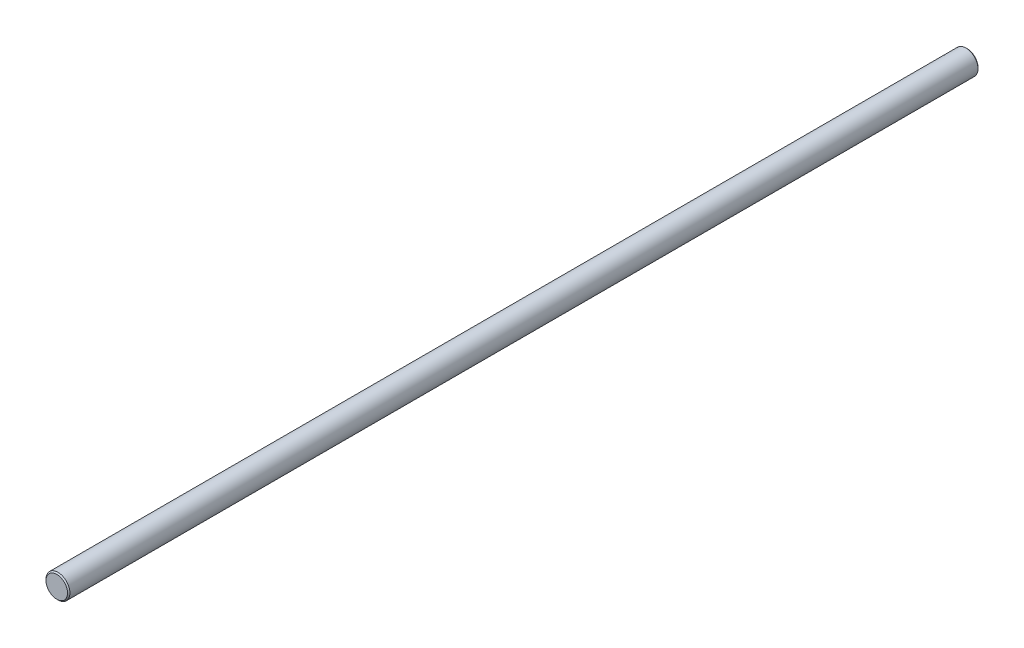
ISO-10303-21;
HEADER;
FILE_DESCRIPTION(('STEP AP214'),'2;1');
FILE_NAME('part.step','',(''),(''),'','','');
FILE_SCHEMA(('AUTOMOTIVE_DESIGN { 1 0 10303 214 1 1 1 1 }'));
ENDSEC;
DATA;
#1=APPLICATION_CONTEXT('core data for automotive mechanical design processes');
#2=APPLICATION_PROTOCOL_DEFINITION('international standard','automotive_design',2000,#1);
#3=PRODUCT_CONTEXT('',#1,'mechanical');
#4=PRODUCT('Part','Part','',(#3));
#5=PRODUCT_RELATED_PRODUCT_CATEGORY('part','',(#4));
#6=PRODUCT_DEFINITION_FORMATION('','',#4);
#7=PRODUCT_DEFINITION_CONTEXT('part definition',#1,'design');
#8=PRODUCT_DEFINITION('design','',#6,#7);
#9=PRODUCT_DEFINITION_SHAPE('','',#8);
#10=(LENGTH_UNIT() NAMED_UNIT(*) SI_UNIT(.MILLI.,.METRE.));
#11=(NAMED_UNIT(*) PLANE_ANGLE_UNIT() SI_UNIT($,.RADIAN.));
#12=(NAMED_UNIT(*) SI_UNIT($,.STERADIAN.) SOLID_ANGLE_UNIT());
#13=UNCERTAINTY_MEASURE_WITH_UNIT(LENGTH_MEASURE(1.E-05),#10,'distance_accuracy_value','');
#14=(GEOMETRIC_REPRESENTATION_CONTEXT(3) GLOBAL_UNCERTAINTY_ASSIGNED_CONTEXT((#13)) GLOBAL_UNIT_ASSIGNED_CONTEXT((#10,
#11,#12)) REPRESENTATION_CONTEXT('',''));
#15=CARTESIAN_POINT('',(0.,0.,0.));
#16=DIRECTION('',(0.,0.,1.));
#17=DIRECTION('',(1.,0.,0.));
#18=AXIS2_PLACEMENT_3D('',#15,#16,#17);
#19=CARTESIAN_POINT('',(0.,0.,-380.));
#20=DIRECTION('',(0.,0.,1.));
#21=DIRECTION('',(1.,0.,0.));
#22=AXIS2_PLACEMENT_3D('',#19,#20,#21);
#23=CYLINDRICAL_SURFACE('',#22,5.);
#24=CARTESIAN_POINT('',(0.,0.,-379.5));
#25=DIRECTION('',(0.,0.,1.));
#26=DIRECTION('',(1.,0.,0.));
#27=AXIS2_PLACEMENT_3D('',#24,#25,#26);
#28=CIRCLE('',#27,5.);
#29=CARTESIAN_POINT('',(5.,0.,-379.5));
#30=VERTEX_POINT('',#29);
#31=EDGE_CURVE('E45',#30,#30,#28,.T.);
#32=ORIENTED_EDGE('',*,*,#31,.T.);
#33=EDGE_LOOP('',(#32));
#34=FACE_BOUND('',#33,.T.);
#35=CARTESIAN_POINT('',(0.,0.,-0.5));
#36=DIRECTION('',(0.,0.,1.));
#37=DIRECTION('',(1.,0.,0.));
#38=AXIS2_PLACEMENT_3D('',#35,#36,#37);
#39=CIRCLE('',#38,5.);
#40=CARTESIAN_POINT('',(5.,0.,-0.5));
#41=VERTEX_POINT('',#40);
#42=EDGE_CURVE('E49',#41,#41,#39,.F.);
#43=ORIENTED_EDGE('',*,*,#42,.T.);
#44=EDGE_LOOP('',(#43));
#45=FACE_BOUND('',#44,.T.);
#46=ADVANCED_FACE('F34',(#34,#45),#23,.T.);
#47=CARTESIAN_POINT('',(0.,0.,-380.));
#48=DIRECTION('',(0.,0.,1.));
#49=DIRECTION('',(1.,0.,0.));
#50=AXIS2_PLACEMENT_3D('',#47,#48,#49);
#51=PLANE('',#50);
#52=CARTESIAN_POINT('',(0.,0.,-380.));
#53=DIRECTION('',(0.,0.,1.));
#54=DIRECTION('',(1.,0.,0.));
#55=AXIS2_PLACEMENT_3D('',#52,#53,#54);
#56=CIRCLE('',#55,4.50000000000006);
#57=CARTESIAN_POINT('',(4.50000000000006,0.,-380.));
#58=VERTEX_POINT('',#57);
#59=EDGE_CURVE('E41',#58,#58,#56,.F.);
#60=ORIENTED_EDGE('',*,*,#59,.T.);
#61=EDGE_LOOP('',(#60));
#62=FACE_BOUND('',#61,.T.);
#63=ADVANCED_FACE('F65',(#62),#51,.F.);
#64=CARTESIAN_POINT('',(0.,0.,0.));
#65=DIRECTION('',(0.,0.,1.));
#66=DIRECTION('',(1.,0.,0.));
#67=AXIS2_PLACEMENT_3D('',#64,#65,#66);
#68=PLANE('',#67);
#69=CARTESIAN_POINT('',(0.,0.,0.));
#70=DIRECTION('',(0.,0.,1.));
#71=DIRECTION('',(1.,0.,0.));
#72=AXIS2_PLACEMENT_3D('',#69,#70,#71);
#73=CIRCLE('',#72,4.5);
#74=CARTESIAN_POINT('',(4.5,0.,0.));
#75=VERTEX_POINT('',#74);
#76=EDGE_CURVE('E10',#75,#75,#73,.T.);
#77=ORIENTED_EDGE('',*,*,#76,.T.);
#78=EDGE_LOOP('',(#77));
#79=FACE_BOUND('',#78,.T.);
#80=ADVANCED_FACE('F62',(#79),#68,.T.);
#81=CARTESIAN_POINT('',(0.,0.,-379.5));
#82=DIRECTION('',(0.,0.,1.));
#83=DIRECTION('',(1.,0.,0.));
#84=AXIS2_PLACEMENT_3D('',#81,#82,#83);
#85=CONICAL_SURFACE('',#84,5.,0.785398163397444);
#86=ORIENTED_EDGE('',*,*,#59,.F.);
#87=EDGE_LOOP('',(#86));
#88=FACE_BOUND('',#87,.T.);
#89=ORIENTED_EDGE('',*,*,#31,.F.);
#90=EDGE_LOOP('',(#89));
#91=FACE_BOUND('',#90,.T.);
#92=ADVANCED_FACE('F58',(#88,#91),#85,.T.);
#93=CARTESIAN_POINT('',(0.,0.,0.));
#94=DIRECTION('',(0.,0.,-1.));
#95=DIRECTION('',(-1.,0.,0.));
#96=AXIS2_PLACEMENT_3D('',#93,#94,#95);
#97=CONICAL_SURFACE('',#96,4.5,0.785398163397444);
#98=ORIENTED_EDGE('',*,*,#42,.F.);
#99=EDGE_LOOP('',(#98));
#100=FACE_BOUND('',#99,.T.);
#101=ORIENTED_EDGE('',*,*,#76,.F.);
#102=EDGE_LOOP('',(#101));
#103=FACE_BOUND('',#102,.T.);
#104=ADVANCED_FACE('F36',(#100,#103),#97,.T.);
#105=CLOSED_SHELL('',(#46,#63,#80,#92,#104));
#106=MANIFOLD_SOLID_BREP('B2',#105);
#107=ADVANCED_BREP_SHAPE_REPRESENTATION('',(#18,#106),#14);
#108=SHAPE_DEFINITION_REPRESENTATION(#9,#107);
ENDSEC;
END-ISO-10303-21;
